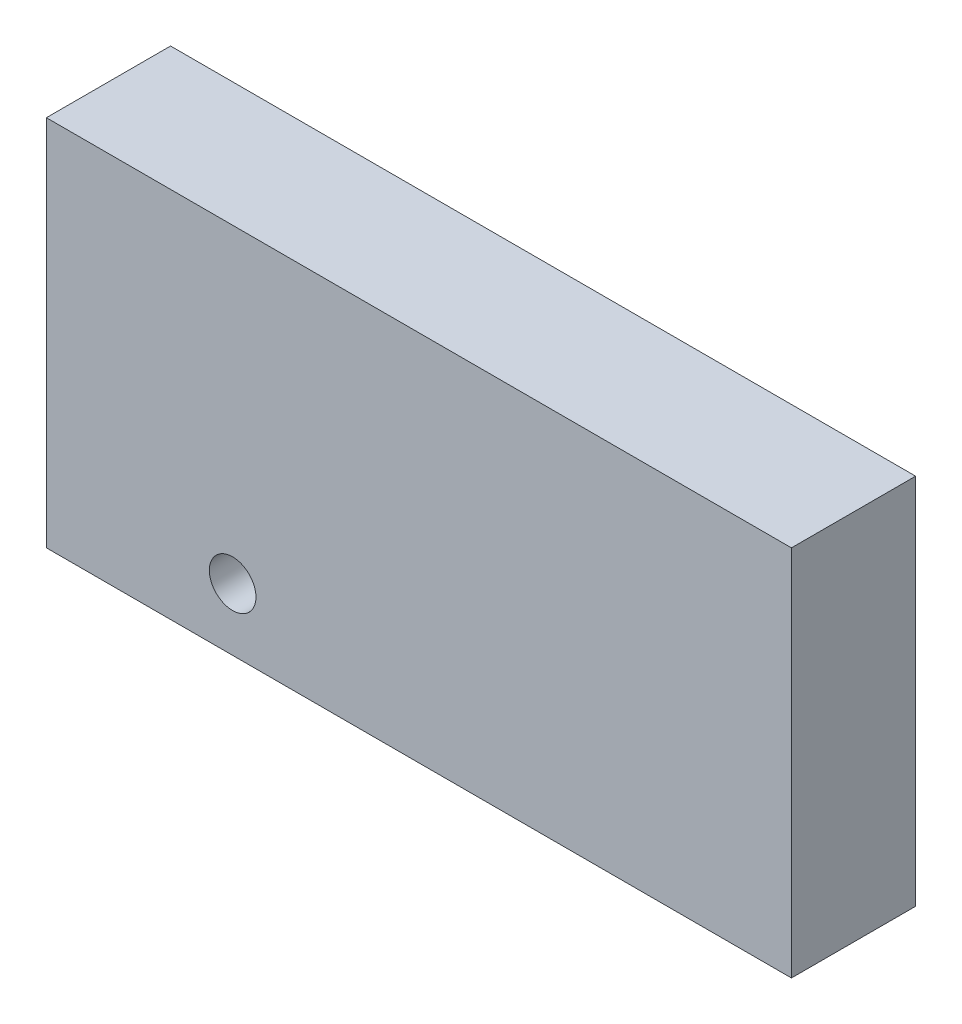
ISO-10303-21;
HEADER;
FILE_DESCRIPTION(('STEP AP214'),'2;1');
FILE_NAME('part.step','',(''),(''),'','','');
FILE_SCHEMA(('AUTOMOTIVE_DESIGN { 1 0 10303 214 1 1 1 1 }'));
ENDSEC;
DATA;
#1=APPLICATION_CONTEXT('core data for automotive mechanical design processes');
#2=APPLICATION_PROTOCOL_DEFINITION('international standard','automotive_design',2000,#1);
#3=PRODUCT_CONTEXT('',#1,'mechanical');
#4=PRODUCT('Part','Part','',(#3));
#5=PRODUCT_RELATED_PRODUCT_CATEGORY('part','',(#4));
#6=PRODUCT_DEFINITION_FORMATION('','',#4);
#7=PRODUCT_DEFINITION_CONTEXT('part definition',#1,'design');
#8=PRODUCT_DEFINITION('design','',#6,#7);
#9=PRODUCT_DEFINITION_SHAPE('','',#8);
#10=(LENGTH_UNIT() NAMED_UNIT(*) SI_UNIT(.MILLI.,.METRE.));
#11=(NAMED_UNIT(*) PLANE_ANGLE_UNIT() SI_UNIT($,.RADIAN.));
#12=(NAMED_UNIT(*) SI_UNIT($,.STERADIAN.) SOLID_ANGLE_UNIT());
#13=UNCERTAINTY_MEASURE_WITH_UNIT(LENGTH_MEASURE(1.E-05),#10,'distance_accuracy_value','');
#14=(GEOMETRIC_REPRESENTATION_CONTEXT(3) GLOBAL_UNCERTAINTY_ASSIGNED_CONTEXT((#13)) GLOBAL_UNIT_ASSIGNED_CONTEXT((#10,
#11,#12)) REPRESENTATION_CONTEXT('',''));
#15=CARTESIAN_POINT('',(0.,0.,0.));
#16=DIRECTION('',(0.,0.,1.));
#17=DIRECTION('',(1.,0.,0.));
#18=AXIS2_PLACEMENT_3D('',#15,#16,#17);
#19=CARTESIAN_POINT('',(76.2,-38.1,25.4));
#20=DIRECTION('',(-1.,0.,0.));
#21=DIRECTION('',(0.,0.,1.));
#22=AXIS2_PLACEMENT_3D('',#19,#20,#21);
#23=PLANE('',#22);
#24=DIRECTION('',(0.,1.,0.));
#25=VECTOR('',#24,1.);
#26=CARTESIAN_POINT('',(76.2,-38.1,0.));
#27=LINE('',#26,#25);
#28=CARTESIAN_POINT('',(76.2,-38.1,0.));
#29=VERTEX_POINT('',#28);
#30=CARTESIAN_POINT('',(76.2,38.1,0.));
#31=VERTEX_POINT('',#30);
#32=EDGE_CURVE('E107',#29,#31,#27,.T.);
#33=ORIENTED_EDGE('',*,*,#32,.T.);
#34=DIRECTION('',(0.,0.,-1.));
#35=VECTOR('',#34,1.);
#36=CARTESIAN_POINT('',(76.2,38.1,25.4));
#37=LINE('',#36,#35);
#38=CARTESIAN_POINT('',(76.2,38.1,25.4));
#39=VERTEX_POINT('',#38);
#40=EDGE_CURVE('E11',#39,#31,#37,.T.);
#41=ORIENTED_EDGE('',*,*,#40,.F.);
#42=DIRECTION('',(0.,1.,0.));
#43=VECTOR('',#42,1.);
#44=CARTESIAN_POINT('',(76.2,-38.1,25.4));
#45=LINE('',#44,#43);
#46=CARTESIAN_POINT('',(76.2,-38.1,25.4));
#47=VERTEX_POINT('',#46);
#48=EDGE_CURVE('E91',#47,#39,#45,.T.);
#49=ORIENTED_EDGE('',*,*,#48,.F.);
#50=DIRECTION('',(0.,0.,-1.));
#51=VECTOR('',#50,1.);
#52=CARTESIAN_POINT('',(76.2,-38.1,25.4));
#53=LINE('',#52,#51);
#54=EDGE_CURVE('E103',#47,#29,#53,.T.);
#55=ORIENTED_EDGE('',*,*,#54,.T.);
#56=EDGE_LOOP('',(#33,#41,#49,#55));
#57=FACE_BOUND('',#56,.T.);
#58=ADVANCED_FACE('F39',(#57),#23,.F.);
#59=CARTESIAN_POINT('',(-76.2,38.1,25.4));
#60=DIRECTION('',(0.,-1.,0.));
#61=DIRECTION('',(0.,0.,-1.));
#62=AXIS2_PLACEMENT_3D('',#59,#60,#61);
#63=PLANE('',#62);
#64=DIRECTION('',(-1.,0.,0.));
#65=VECTOR('',#64,1.);
#66=CARTESIAN_POINT('',(-76.2,38.1,0.));
#67=LINE('',#66,#65);
#68=CARTESIAN_POINT('',(-76.2,38.1,0.));
#69=VERTEX_POINT('',#68);
#70=EDGE_CURVE('E96',#31,#69,#67,.T.);
#71=ORIENTED_EDGE('',*,*,#70,.T.);
#72=DIRECTION('',(0.,0.,-1.));
#73=VECTOR('',#72,1.);
#74=CARTESIAN_POINT('',(-76.2,38.1,25.4));
#75=LINE('',#74,#73);
#76=CARTESIAN_POINT('',(-76.2,38.1,25.4));
#77=VERTEX_POINT('',#76);
#78=EDGE_CURVE('E48',#77,#69,#75,.T.);
#79=ORIENTED_EDGE('',*,*,#78,.F.);
#80=DIRECTION('',(-1.,0.,0.));
#81=VECTOR('',#80,1.);
#82=CARTESIAN_POINT('',(-76.2,38.1,25.4));
#83=LINE('',#82,#81);
#84=EDGE_CURVE('E86',#39,#77,#83,.T.);
#85=ORIENTED_EDGE('',*,*,#84,.F.);
#86=ORIENTED_EDGE('',*,*,#40,.T.);
#87=EDGE_LOOP('',(#71,#79,#85,#86));
#88=FACE_BOUND('',#87,.T.);
#89=ADVANCED_FACE('F95',(#88),#63,.F.);
#90=CARTESIAN_POINT('',(-76.2,-38.1,25.4));
#91=DIRECTION('',(1.,0.,0.));
#92=DIRECTION('',(0.,0.,-1.));
#93=AXIS2_PLACEMENT_3D('',#90,#91,#92);
#94=PLANE('',#93);
#95=DIRECTION('',(0.,-1.,0.));
#96=VECTOR('',#95,1.);
#97=CARTESIAN_POINT('',(-76.2,-38.1,0.));
#98=LINE('',#97,#96);
#99=CARTESIAN_POINT('',(-76.2,-38.1,0.));
#100=VERTEX_POINT('',#99);
#101=EDGE_CURVE('E73',#69,#100,#98,.T.);
#102=ORIENTED_EDGE('',*,*,#101,.T.);
#103=DIRECTION('',(0.,0.,-1.));
#104=VECTOR('',#103,1.);
#105=CARTESIAN_POINT('',(-76.2,-38.1,25.4));
#106=LINE('',#105,#104);
#107=CARTESIAN_POINT('',(-76.2,-38.1,25.4));
#108=VERTEX_POINT('',#107);
#109=EDGE_CURVE('E98',#108,#100,#106,.T.);
#110=ORIENTED_EDGE('',*,*,#109,.F.);
#111=DIRECTION('',(0.,-1.,0.));
#112=VECTOR('',#111,1.);
#113=CARTESIAN_POINT('',(-76.2,-38.1,25.4));
#114=LINE('',#113,#112);
#115=EDGE_CURVE('E89',#77,#108,#114,.T.);
#116=ORIENTED_EDGE('',*,*,#115,.F.);
#117=ORIENTED_EDGE('',*,*,#78,.T.);
#118=EDGE_LOOP('',(#102,#110,#116,#117));
#119=FACE_BOUND('',#118,.T.);
#120=ADVANCED_FACE('F99',(#119),#94,.F.);
#121=CARTESIAN_POINT('',(-76.2,-38.1,25.4));
#122=DIRECTION('',(0.,1.,0.));
#123=DIRECTION('',(0.,0.,1.));
#124=AXIS2_PLACEMENT_3D('',#121,#122,#123);
#125=PLANE('',#124);
#126=DIRECTION('',(1.,0.,0.));
#127=VECTOR('',#126,1.);
#128=CARTESIAN_POINT('',(-76.2,-38.1,0.));
#129=LINE('',#128,#127);
#130=EDGE_CURVE('E79',#100,#29,#129,.T.);
#131=ORIENTED_EDGE('',*,*,#130,.T.);
#132=ORIENTED_EDGE('',*,*,#54,.F.);
#133=DIRECTION('',(1.,0.,0.));
#134=VECTOR('',#133,1.);
#135=CARTESIAN_POINT('',(-76.2,-38.1,25.4));
#136=LINE('',#135,#134);
#137=EDGE_CURVE('E56',#108,#47,#136,.T.);
#138=ORIENTED_EDGE('',*,*,#137,.F.);
#139=ORIENTED_EDGE('',*,*,#109,.T.);
#140=EDGE_LOOP('',(#131,#132,#138,#139));
#141=FACE_BOUND('',#140,.T.);
#142=ADVANCED_FACE('F121',(#141),#125,.F.);
#143=CARTESIAN_POINT('',(0.,0.,25.4));
#144=DIRECTION('',(0.,0.,-1.));
#145=DIRECTION('',(-1.,0.,0.));
#146=AXIS2_PLACEMENT_3D('',#143,#144,#145);
#147=PLANE('',#146);
#148=CARTESIAN_POINT('',(-38.1,-25.4,25.4));
#149=DIRECTION('',(0.,0.,1.));
#150=DIRECTION('',(1.,0.,0.));
#151=AXIS2_PLACEMENT_3D('',#148,#149,#150);
#152=CIRCLE('',#151,4.7625);
#153=CARTESIAN_POINT('',(-33.3375,-25.4,25.4));
#154=VERTEX_POINT('',#153);
#155=EDGE_CURVE('E128',#154,#154,#152,.T.);
#156=ORIENTED_EDGE('',*,*,#155,.F.);
#157=EDGE_LOOP('',(#156));
#158=FACE_BOUND('',#157,.T.);
#159=ORIENTED_EDGE('',*,*,#48,.T.);
#160=ORIENTED_EDGE('',*,*,#84,.T.);
#161=ORIENTED_EDGE('',*,*,#115,.T.);
#162=ORIENTED_EDGE('',*,*,#137,.T.);
#163=EDGE_LOOP('',(#159,#160,#161,#162));
#164=FACE_BOUND('',#163,.T.);
#165=ADVANCED_FACE('F87',(#158,#164),#147,.F.);
#166=CARTESIAN_POINT('',(0.,0.,0.));
#167=DIRECTION('',(0.,0.,-1.));
#168=DIRECTION('',(-1.,0.,0.));
#169=AXIS2_PLACEMENT_3D('',#166,#167,#168);
#170=PLANE('',#169);
#171=CARTESIAN_POINT('',(-63.5,25.4,0.));
#172=DIRECTION('',(0.,0.,-1.));
#173=DIRECTION('',(-1.,0.,0.));
#174=AXIS2_PLACEMENT_3D('',#171,#172,#173);
#175=CIRCLE('',#174,4.7625);
#176=CARTESIAN_POINT('',(-68.2625,25.4,0.));
#177=VERTEX_POINT('',#176);
#178=EDGE_CURVE('E144',#177,#177,#175,.T.);
#179=ORIENTED_EDGE('',*,*,#178,.F.);
#180=EDGE_LOOP('',(#179));
#181=FACE_BOUND('',#180,.T.);
#182=CARTESIAN_POINT('',(63.5,25.4,0.));
#183=DIRECTION('',(0.,0.,-1.));
#184=DIRECTION('',(-1.,0.,0.));
#185=AXIS2_PLACEMENT_3D('',#182,#183,#184);
#186=CIRCLE('',#185,4.7625);
#187=CARTESIAN_POINT('',(58.7375,25.4,0.));
#188=VERTEX_POINT('',#187);
#189=EDGE_CURVE('E136',#188,#188,#186,.T.);
#190=ORIENTED_EDGE('',*,*,#189,.F.);
#191=EDGE_LOOP('',(#190));
#192=FACE_BOUND('',#191,.T.);
#193=ORIENTED_EDGE('',*,*,#32,.F.);
#194=ORIENTED_EDGE('',*,*,#130,.F.);
#195=ORIENTED_EDGE('',*,*,#101,.F.);
#196=ORIENTED_EDGE('',*,*,#70,.F.);
#197=EDGE_LOOP('',(#193,#194,#195,#196));
#198=FACE_BOUND('',#197,.T.);
#199=ADVANCED_FACE('F124',(#181,#192,#198),#170,.T.);
#200=CARTESIAN_POINT('',(-38.1,-25.4,12.7));
#201=DIRECTION('',(0.,0.,1.));
#202=DIRECTION('',(1.,0.,0.));
#203=AXIS2_PLACEMENT_3D('',#200,#201,#202);
#204=CYLINDRICAL_SURFACE('',#203,4.7625);
#205=CARTESIAN_POINT('',(-38.1,-25.4,12.7));
#206=DIRECTION('',(0.,0.,1.));
#207=DIRECTION('',(1.,0.,0.));
#208=AXIS2_PLACEMENT_3D('',#205,#206,#207);
#209=CIRCLE('',#208,4.7625);
#210=CARTESIAN_POINT('',(-33.3375,-25.4,12.7));
#211=VERTEX_POINT('',#210);
#212=EDGE_CURVE('E111',#211,#211,#209,.T.);
#213=ORIENTED_EDGE('',*,*,#212,.F.);
#214=EDGE_LOOP('',(#213));
#215=FACE_BOUND('',#214,.T.);
#216=ORIENTED_EDGE('',*,*,#155,.T.);
#217=EDGE_LOOP('',(#216));
#218=FACE_BOUND('',#217,.T.);
#219=ADVANCED_FACE('F163',(#215,#218),#204,.F.);
#220=CARTESIAN_POINT('',(-38.1,-25.4,12.7));
#221=DIRECTION('',(0.,0.,1.));
#222=DIRECTION('',(1.,0.,0.));
#223=AXIS2_PLACEMENT_3D('',#220,#221,#222);
#224=PLANE('',#223);
#225=ORIENTED_EDGE('',*,*,#212,.T.);
#226=EDGE_LOOP('',(#225));
#227=FACE_BOUND('',#226,.T.);
#228=ADVANCED_FACE('F169',(#227),#224,.T.);
#229=CARTESIAN_POINT('',(63.5,25.4,12.7));
#230=DIRECTION('',(0.,0.,-1.));
#231=DIRECTION('',(-1.,0.,0.));
#232=AXIS2_PLACEMENT_3D('',#229,#230,#231);
#233=CYLINDRICAL_SURFACE('',#232,4.7625);
#234=CARTESIAN_POINT('',(63.5,25.4,12.7));
#235=DIRECTION('',(0.,0.,-1.));
#236=DIRECTION('',(-1.,0.,0.));
#237=AXIS2_PLACEMENT_3D('',#234,#235,#236);
#238=CIRCLE('',#237,4.7625);
#239=CARTESIAN_POINT('',(58.7375,25.4,12.7));
#240=VERTEX_POINT('',#239);
#241=EDGE_CURVE('E140',#240,#240,#238,.T.);
#242=ORIENTED_EDGE('',*,*,#241,.F.);
#243=EDGE_LOOP('',(#242));
#244=FACE_BOUND('',#243,.T.);
#245=ORIENTED_EDGE('',*,*,#189,.T.);
#246=EDGE_LOOP('',(#245));
#247=FACE_BOUND('',#246,.T.);
#248=ADVANCED_FACE('F167',(#244,#247),#233,.F.);
#249=CARTESIAN_POINT('',(63.5,25.4,12.7));
#250=DIRECTION('',(0.,0.,-1.));
#251=DIRECTION('',(-1.,0.,0.));
#252=AXIS2_PLACEMENT_3D('',#249,#250,#251);
#253=PLANE('',#252);
#254=ORIENTED_EDGE('',*,*,#241,.T.);
#255=EDGE_LOOP('',(#254));
#256=FACE_BOUND('',#255,.T.);
#257=ADVANCED_FACE('F157',(#256),#253,.T.);
#258=CARTESIAN_POINT('',(-63.5,25.4,12.7));
#259=DIRECTION('',(0.,0.,-1.));
#260=DIRECTION('',(-1.,0.,0.));
#261=AXIS2_PLACEMENT_3D('',#258,#259,#260);
#262=CYLINDRICAL_SURFACE('',#261,4.7625);
#263=CARTESIAN_POINT('',(-63.5,25.4,12.7));
#264=DIRECTION('',(0.,0.,-1.));
#265=DIRECTION('',(-1.,0.,0.));
#266=AXIS2_PLACEMENT_3D('',#263,#264,#265);
#267=CIRCLE('',#266,4.7625);
#268=CARTESIAN_POINT('',(-68.2625,25.4,12.7));
#269=VERTEX_POINT('',#268);
#270=EDGE_CURVE('E132',#269,#269,#267,.T.);
#271=ORIENTED_EDGE('',*,*,#270,.F.);
#272=EDGE_LOOP('',(#271));
#273=FACE_BOUND('',#272,.T.);
#274=ORIENTED_EDGE('',*,*,#178,.T.);
#275=EDGE_LOOP('',(#274));
#276=FACE_BOUND('',#275,.T.);
#277=ADVANCED_FACE('F154',(#273,#276),#262,.F.);
#278=CARTESIAN_POINT('',(-63.5,25.4,12.7));
#279=DIRECTION('',(0.,0.,-1.));
#280=DIRECTION('',(-1.,0.,0.));
#281=AXIS2_PLACEMENT_3D('',#278,#279,#280);
#282=PLANE('',#281);
#283=ORIENTED_EDGE('',*,*,#270,.T.);
#284=EDGE_LOOP('',(#283));
#285=FACE_BOUND('',#284,.T.);
#286=ADVANCED_FACE('F152',(#285),#282,.T.);
#287=CLOSED_SHELL('',(#58,#89,#120,#142,#165,#199,#219,#228,#248,#257,#277,#286));
#288=MANIFOLD_SOLID_BREP('B2',#287);
#289=ADVANCED_BREP_SHAPE_REPRESENTATION('',(#18,#288),#14);
#290=SHAPE_DEFINITION_REPRESENTATION(#9,#289);
ENDSEC;
END-ISO-10303-21;
